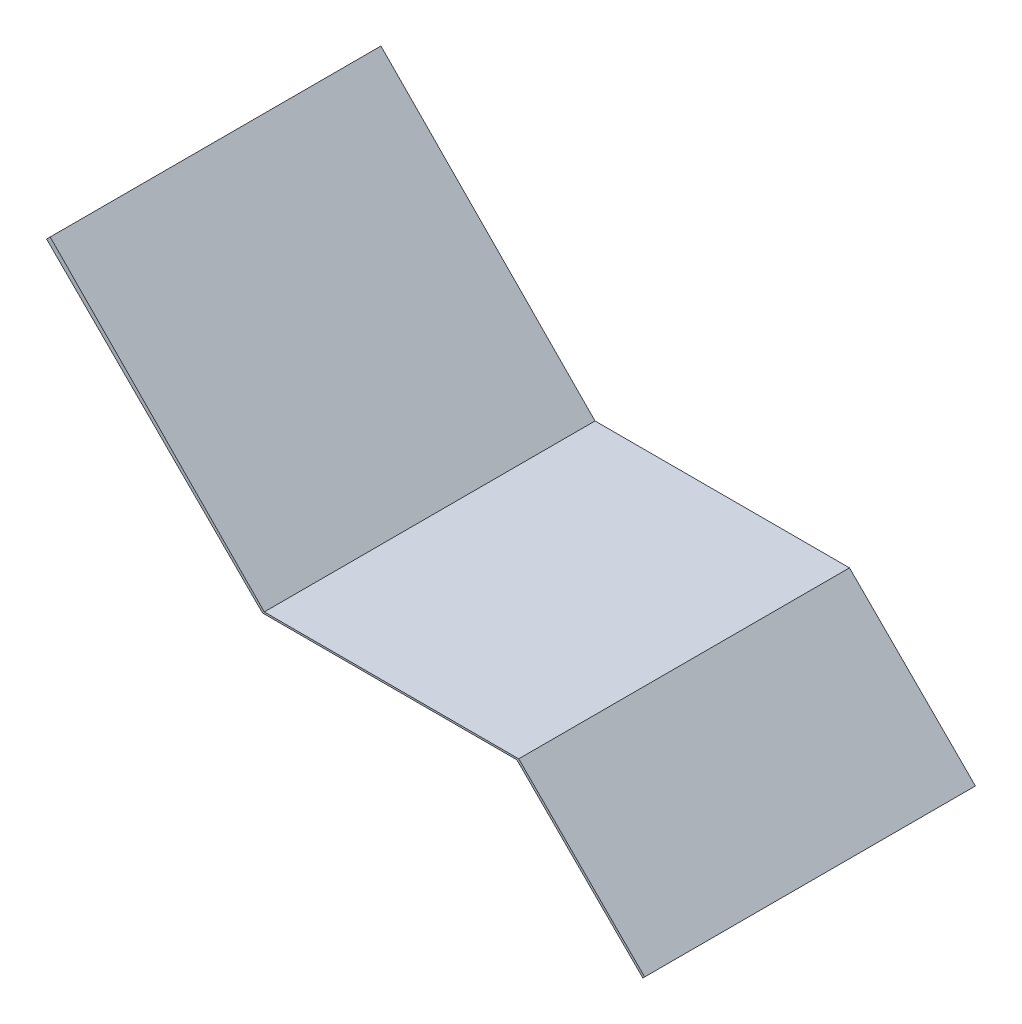
ISO-10303-21;
HEADER;
FILE_DESCRIPTION(('STEP AP214'),'2;1');
FILE_NAME('part.step','',(''),(''),'','','');
FILE_SCHEMA(('AUTOMOTIVE_DESIGN { 1 0 10303 214 1 1 1 1 }'));
ENDSEC;
DATA;
#1=APPLICATION_CONTEXT('core data for automotive mechanical design processes');
#2=APPLICATION_PROTOCOL_DEFINITION('international standard','automotive_design',2000,#1);
#3=PRODUCT_CONTEXT('',#1,'mechanical');
#4=PRODUCT('Part','Part','',(#3));
#5=PRODUCT_RELATED_PRODUCT_CATEGORY('part','',(#4));
#6=PRODUCT_DEFINITION_FORMATION('','',#4);
#7=PRODUCT_DEFINITION_CONTEXT('part definition',#1,'design');
#8=PRODUCT_DEFINITION('design','',#6,#7);
#9=PRODUCT_DEFINITION_SHAPE('','',#8);
#10=(LENGTH_UNIT() NAMED_UNIT(*) SI_UNIT(.MILLI.,.METRE.));
#11=(NAMED_UNIT(*) PLANE_ANGLE_UNIT() SI_UNIT($,.RADIAN.));
#12=(NAMED_UNIT(*) SI_UNIT($,.STERADIAN.) SOLID_ANGLE_UNIT());
#13=UNCERTAINTY_MEASURE_WITH_UNIT(LENGTH_MEASURE(1.E-05),#10,'distance_accuracy_value','');
#14=(GEOMETRIC_REPRESENTATION_CONTEXT(3) GLOBAL_UNCERTAINTY_ASSIGNED_CONTEXT((#13)) GLOBAL_UNIT_ASSIGNED_CONTEXT((#10,
#11,#12)) REPRESENTATION_CONTEXT('',''));
#15=CARTESIAN_POINT('',(0.,0.,0.));
#16=DIRECTION('',(0.,0.,1.));
#17=DIRECTION('',(1.,0.,0.));
#18=AXIS2_PLACEMENT_3D('',#15,#16,#17);
#19=CARTESIAN_POINT('',(-59.4653823744208,52.7228393345862,650.));
#20=DIRECTION('',(0.707106781186547,-0.707106781186547,0.));
#21=DIRECTION('',(0.707106781186548,0.707106781186548,0.));
#22=AXIS2_PLACEMENT_3D('',#19,#20,#21);
#23=PLANE('',#22);
#24=DIRECTION('',(-0.707106781186547,-0.707106781186547,0.));
#25=VECTOR('',#24,1.);
#26=CARTESIAN_POINT('',(-59.4653823744208,52.7228393345862,0.));
#27=LINE('',#26,#25);
#28=CARTESIAN_POINT('',(-59.4653823744208,52.7228393345862,0.));
#29=VERTEX_POINT('',#28);
#30=CARTESIAN_POINT('',(-66.5115885846255,45.6766331243814,0.));
#31=VERTEX_POINT('',#30);
#32=EDGE_CURVE('E131',#29,#31,#27,.T.);
#33=ORIENTED_EDGE('',*,*,#32,.T.);
#34=DIRECTION('',(0.,0.,-1.));
#35=VECTOR('',#34,1.);
#36=CARTESIAN_POINT('',(-66.5115885846255,45.6766331243814,650.));
#37=LINE('',#36,#35);
#38=CARTESIAN_POINT('',(-66.5115885846255,45.6766331243814,650.));
#39=VERTEX_POINT('',#38);
#40=EDGE_CURVE('E11',#39,#31,#37,.T.);
#41=ORIENTED_EDGE('',*,*,#40,.F.);
#42=DIRECTION('',(-0.707106781186547,-0.707106781186547,0.));
#43=VECTOR('',#42,1.);
#44=CARTESIAN_POINT('',(-59.4653823744208,52.7228393345862,650.));
#45=LINE('',#44,#43);
#46=CARTESIAN_POINT('',(-59.4653823744208,52.7228393345862,650.));
#47=VERTEX_POINT('',#46);
#48=EDGE_CURVE('E145',#47,#39,#45,.T.);
#49=ORIENTED_EDGE('',*,*,#48,.F.);
#50=DIRECTION('',(0.,0.,-1.));
#51=VECTOR('',#50,1.);
#52=CARTESIAN_POINT('',(-59.4653823744208,52.7228393345862,650.));
#53=LINE('',#52,#51);
#54=EDGE_CURVE('E127',#47,#29,#53,.T.);
#55=ORIENTED_EDGE('',*,*,#54,.T.);
#56=EDGE_LOOP('',(#33,#41,#49,#55));
#57=FACE_BOUND('',#56,.T.);
#58=ADVANCED_FACE('F35',(#57),#23,.F.);
#59=CARTESIAN_POINT('',(-66.5115885846255,45.6766331243814,650.));
#60=DIRECTION('',(0.707106781186548,0.707106781186548,0.));
#61=DIRECTION('',(-0.707106781186548,0.707106781186548,0.));
#62=AXIS2_PLACEMENT_3D('',#59,#60,#61);
#63=PLANE('',#62);
#64=DIRECTION('',(0.707106781186548,-0.707106781186548,0.));
#65=VECTOR('',#64,1.);
#66=CARTESIAN_POINT('',(-66.5115885846255,45.6766331243814,0.));
#67=LINE('',#66,#65);
#68=CARTESIAN_POINT('',(357.752480127303,-378.587435587547,0.));
#69=VERTEX_POINT('',#68);
#70=EDGE_CURVE('E134',#31,#69,#67,.T.);
#71=ORIENTED_EDGE('',*,*,#70,.T.);
#72=DIRECTION('',(0.,0.,-1.));
#73=VECTOR('',#72,1.);
#74=CARTESIAN_POINT('',(357.752480127303,-378.587435587547,650.));
#75=LINE('',#74,#73);
#76=CARTESIAN_POINT('',(357.752480127303,-378.587435587547,650.));
#77=VERTEX_POINT('',#76);
#78=EDGE_CURVE('E43',#77,#69,#75,.T.);
#79=ORIENTED_EDGE('',*,*,#78,.F.);
#80=DIRECTION('',(0.707106781186548,-0.707106781186548,0.));
#81=VECTOR('',#80,1.);
#82=CARTESIAN_POINT('',(-66.5115885846255,45.6766331243814,650.));
#83=LINE('',#82,#81);
#84=EDGE_CURVE('E94',#39,#77,#83,.T.);
#85=ORIENTED_EDGE('',*,*,#84,.F.);
#86=ORIENTED_EDGE('',*,*,#40,.T.);
#87=EDGE_LOOP('',(#71,#79,#85,#86));
#88=FACE_BOUND('',#87,.T.);
#89=ADVANCED_FACE('F180',(#88),#63,.F.);
#90=CARTESIAN_POINT('',(357.752480127303,-378.587435587547,650.));
#91=DIRECTION('',(0.,1.,0.));
#92=DIRECTION('',(0.,0.,1.));
#93=AXIS2_PLACEMENT_3D('',#90,#91,#92);
#94=PLANE('',#93);
#95=DIRECTION('',(1.,0.,0.));
#96=VECTOR('',#95,1.);
#97=CARTESIAN_POINT('',(357.752480127303,-378.587435587547,0.));
#98=LINE('',#97,#96);
#99=CARTESIAN_POINT('',(857.752480127303,-378.587435587547,0.));
#100=VERTEX_POINT('',#99);
#101=EDGE_CURVE('E136',#69,#100,#98,.T.);
#102=ORIENTED_EDGE('',*,*,#101,.T.);
#103=DIRECTION('',(0.,0.,-1.));
#104=VECTOR('',#103,1.);
#105=CARTESIAN_POINT('',(857.752480127303,-378.587435587547,650.));
#106=LINE('',#105,#104);
#107=CARTESIAN_POINT('',(857.752480127303,-378.587435587547,650.));
#108=VERTEX_POINT('',#107);
#109=EDGE_CURVE('E152',#108,#100,#106,.T.);
#110=ORIENTED_EDGE('',*,*,#109,.F.);
#111=DIRECTION('',(1.,0.,0.));
#112=VECTOR('',#111,1.);
#113=CARTESIAN_POINT('',(357.752480127303,-378.587435587547,650.));
#114=LINE('',#113,#112);
#115=EDGE_CURVE('E160',#77,#108,#114,.T.);
#116=ORIENTED_EDGE('',*,*,#115,.F.);
#117=ORIENTED_EDGE('',*,*,#78,.T.);
#118=EDGE_LOOP('',(#102,#110,#116,#117));
#119=FACE_BOUND('',#118,.T.);
#120=ADVANCED_FACE('F158',(#119),#94,.F.);
#121=CARTESIAN_POINT('',(857.752480127303,-378.587435587547,650.));
#122=DIRECTION('',(0.707106781186548,0.707106781186547,0.));
#123=DIRECTION('',(-0.707106781186547,0.707106781186548,0.));
#124=AXIS2_PLACEMENT_3D('',#121,#122,#123);
#125=PLANE('',#124);
#126=DIRECTION('',(0.707106781186547,-0.707106781186548,0.));
#127=VECTOR('',#126,1.);
#128=CARTESIAN_POINT('',(857.752480127303,-378.587435587547,0.));
#129=LINE('',#128,#127);
#130=CARTESIAN_POINT('',(1105.23985354259,-626.074809002839,0.));
#131=VERTEX_POINT('',#130);
#132=EDGE_CURVE('E138',#100,#131,#129,.T.);
#133=ORIENTED_EDGE('',*,*,#132,.T.);
#134=DIRECTION('',(0.,0.,-1.));
#135=VECTOR('',#134,1.);
#136=CARTESIAN_POINT('',(1105.23985354259,-626.074809002839,650.));
#137=LINE('',#136,#135);
#138=CARTESIAN_POINT('',(1105.23985354259,-626.074809002839,650.));
#139=VERTEX_POINT('',#138);
#140=EDGE_CURVE('E149',#139,#131,#137,.T.);
#141=ORIENTED_EDGE('',*,*,#140,.F.);
#142=DIRECTION('',(0.707106781186547,-0.707106781186548,0.));
#143=VECTOR('',#142,1.);
#144=CARTESIAN_POINT('',(857.752480127303,-378.587435587547,650.));
#145=LINE('',#144,#143);
#146=EDGE_CURVE('E172',#108,#139,#145,.T.);
#147=ORIENTED_EDGE('',*,*,#146,.F.);
#148=ORIENTED_EDGE('',*,*,#109,.T.);
#149=EDGE_LOOP('',(#133,#141,#147,#148));
#150=FACE_BOUND('',#149,.T.);
#151=ADVANCED_FACE('F168',(#150),#125,.F.);
#152=CARTESIAN_POINT('',(1105.23985354259,-626.074809002839,650.));
#153=DIRECTION('',(-0.707106781186559,0.707106781186536,0.));
#154=DIRECTION('',(-0.707106781186536,-0.707106781186559,0.));
#155=AXIS2_PLACEMENT_3D('',#152,#153,#154);
#156=PLANE('',#155);
#157=DIRECTION('',(0.707106781186536,0.707106781186559,0.));
#158=VECTOR('',#157,1.);
#159=CARTESIAN_POINT('',(1105.23985354259,-626.074809002839,0.));
#160=LINE('',#159,#158);
#161=CARTESIAN_POINT('',(1108.77538744853,-622.539275096906,0.));
#162=VERTEX_POINT('',#161);
#163=EDGE_CURVE('E140',#131,#162,#160,.T.);
#164=ORIENTED_EDGE('',*,*,#163,.T.);
#165=DIRECTION('',(0.,0.,-1.));
#166=VECTOR('',#165,1.);
#167=CARTESIAN_POINT('',(1108.77538744853,-622.539275096906,650.));
#168=LINE('',#167,#166);
#169=CARTESIAN_POINT('',(1108.77538744853,-622.539275096906,650.));
#170=VERTEX_POINT('',#169);
#171=EDGE_CURVE('E122',#170,#162,#168,.T.);
#172=ORIENTED_EDGE('',*,*,#171,.F.);
#173=DIRECTION('',(0.707106781186536,0.707106781186559,0.));
#174=VECTOR('',#173,1.);
#175=CARTESIAN_POINT('',(1105.23985354259,-626.074809002839,650.));
#176=LINE('',#175,#174);
#177=EDGE_CURVE('E113',#139,#170,#176,.T.);
#178=ORIENTED_EDGE('',*,*,#177,.F.);
#179=ORIENTED_EDGE('',*,*,#140,.T.);
#180=EDGE_LOOP('',(#164,#172,#178,#179));
#181=FACE_BOUND('',#180,.T.);
#182=ADVANCED_FACE('F171',(#181),#156,.F.);
#183=CARTESIAN_POINT('',(1108.77538744853,-622.539275096906,650.));
#184=DIRECTION('',(-0.707106781186536,-0.707106781186559,0.));
#185=DIRECTION('',(0.707106781186559,-0.707106781186536,0.));
#186=AXIS2_PLACEMENT_3D('',#183,#184,#185);
#187=PLANE('',#186);
#188=DIRECTION('',(-0.707106781186559,0.707106781186536,0.));
#189=VECTOR('',#188,1.);
#190=CARTESIAN_POINT('',(1108.77538744853,-622.539275096906,0.));
#191=LINE('',#190,#189);
#192=CARTESIAN_POINT('',(861.288014033232,-375.051901681618,0.));
#193=VERTEX_POINT('',#192);
#194=EDGE_CURVE('E121',#162,#193,#191,.T.);
#195=ORIENTED_EDGE('',*,*,#194,.T.);
#196=DIRECTION('',(0.,0.,-1.));
#197=VECTOR('',#196,1.);
#198=CARTESIAN_POINT('',(861.288014033232,-375.051901681618,650.));
#199=LINE('',#198,#197);
#200=CARTESIAN_POINT('',(861.288014033232,-375.051901681618,650.));
#201=VERTEX_POINT('',#200);
#202=EDGE_CURVE('E118',#201,#193,#199,.T.);
#203=ORIENTED_EDGE('',*,*,#202,.F.);
#204=DIRECTION('',(-0.707106781186559,0.707106781186536,0.));
#205=VECTOR('',#204,1.);
#206=CARTESIAN_POINT('',(1108.77538744853,-622.539275096906,650.));
#207=LINE('',#206,#205);
#208=EDGE_CURVE('E107',#170,#201,#207,.T.);
#209=ORIENTED_EDGE('',*,*,#208,.F.);
#210=ORIENTED_EDGE('',*,*,#171,.T.);
#211=EDGE_LOOP('',(#195,#203,#209,#210));
#212=FACE_BOUND('',#211,.T.);
#213=ADVANCED_FACE('F119',(#212),#187,.F.);
#214=CARTESIAN_POINT('',(861.288014033232,-375.051901681618,650.));
#215=DIRECTION('',(0.,-1.,0.));
#216=DIRECTION('',(0.,0.,-1.));
#217=AXIS2_PLACEMENT_3D('',#214,#215,#216);
#218=PLANE('',#217);
#219=DIRECTION('',(-1.,0.,0.));
#220=VECTOR('',#219,1.);
#221=CARTESIAN_POINT('',(861.288014033232,-375.051901681618,0.));
#222=LINE('',#221,#220);
#223=CARTESIAN_POINT('',(361.288014033232,-375.051901681618,0.));
#224=VERTEX_POINT('',#223);
#225=EDGE_CURVE('E80',#193,#224,#222,.T.);
#226=ORIENTED_EDGE('',*,*,#225,.T.);
#227=DIRECTION('',(0.,0.,-1.));
#228=VECTOR('',#227,1.);
#229=CARTESIAN_POINT('',(361.288014033232,-375.051901681618,650.));
#230=LINE('',#229,#228);
#231=CARTESIAN_POINT('',(361.288014033232,-375.051901681618,650.));
#232=VERTEX_POINT('',#231);
#233=EDGE_CURVE('E123',#232,#224,#230,.T.);
#234=ORIENTED_EDGE('',*,*,#233,.F.);
#235=DIRECTION('',(-1.,0.,0.));
#236=VECTOR('',#235,1.);
#237=CARTESIAN_POINT('',(861.288014033232,-375.051901681618,650.));
#238=LINE('',#237,#236);
#239=EDGE_CURVE('E111',#201,#232,#238,.T.);
#240=ORIENTED_EDGE('',*,*,#239,.F.);
#241=ORIENTED_EDGE('',*,*,#202,.T.);
#242=EDGE_LOOP('',(#226,#234,#240,#241));
#243=FACE_BOUND('',#242,.T.);
#244=ADVANCED_FACE('F125',(#243),#218,.F.);
#245=CARTESIAN_POINT('',(361.288014033232,-375.051901681618,650.));
#246=DIRECTION('',(-0.712933494397549,-0.701231653996096,0.));
#247=DIRECTION('',(0.701231653996096,-0.712933494397549,0.));
#248=AXIS2_PLACEMENT_3D('',#245,#246,#247);
#249=PLANE('',#248);
#250=DIRECTION('',(-0.701231653996096,0.712933494397549,0.));
#251=VECTOR('',#250,1.);
#252=CARTESIAN_POINT('',(361.288014033232,-375.051901681618,0.));
#253=LINE('',#252,#251);
#254=EDGE_CURVE('E86',#224,#29,#253,.T.);
#255=ORIENTED_EDGE('',*,*,#254,.T.);
#256=ORIENTED_EDGE('',*,*,#54,.F.);
#257=DIRECTION('',(-0.701231653996096,0.712933494397549,0.));
#258=VECTOR('',#257,1.);
#259=CARTESIAN_POINT('',(361.288014033232,-375.051901681618,650.));
#260=LINE('',#259,#258);
#261=EDGE_CURVE('E51',#232,#47,#260,.T.);
#262=ORIENTED_EDGE('',*,*,#261,.F.);
#263=ORIENTED_EDGE('',*,*,#233,.T.);
#264=EDGE_LOOP('',(#255,#256,#262,#263));
#265=FACE_BOUND('',#264,.T.);
#266=ADVANCED_FACE('F196',(#265),#249,.F.);
#267=CARTESIAN_POINT('',(0.,0.,650.));
#268=DIRECTION('',(0.,0.,1.));
#269=DIRECTION('',(1.,0.,0.));
#270=AXIS2_PLACEMENT_3D('',#267,#268,#269);
#271=PLANE('',#270);
#272=ORIENTED_EDGE('',*,*,#48,.T.);
#273=ORIENTED_EDGE('',*,*,#84,.T.);
#274=ORIENTED_EDGE('',*,*,#115,.T.);
#275=ORIENTED_EDGE('',*,*,#146,.T.);
#276=ORIENTED_EDGE('',*,*,#177,.T.);
#277=ORIENTED_EDGE('',*,*,#208,.T.);
#278=ORIENTED_EDGE('',*,*,#239,.T.);
#279=ORIENTED_EDGE('',*,*,#261,.T.);
#280=EDGE_LOOP('',(#272,#273,#274,#275,#276,#277,#278,#279));
#281=FACE_BOUND('',#280,.T.);
#282=ADVANCED_FACE('F109',(#281),#271,.T.);
#283=CARTESIAN_POINT('',(0.,0.,0.));
#284=DIRECTION('',(0.,0.,1.));
#285=DIRECTION('',(1.,0.,0.));
#286=AXIS2_PLACEMENT_3D('',#283,#284,#285);
#287=PLANE('',#286);
#288=ORIENTED_EDGE('',*,*,#32,.F.);
#289=ORIENTED_EDGE('',*,*,#254,.F.);
#290=ORIENTED_EDGE('',*,*,#225,.F.);
#291=ORIENTED_EDGE('',*,*,#194,.F.);
#292=ORIENTED_EDGE('',*,*,#163,.F.);
#293=ORIENTED_EDGE('',*,*,#132,.F.);
#294=ORIENTED_EDGE('',*,*,#101,.F.);
#295=ORIENTED_EDGE('',*,*,#70,.F.);
#296=EDGE_LOOP('',(#288,#289,#290,#291,#292,#293,#294,#295));
#297=FACE_BOUND('',#296,.T.);
#298=ADVANCED_FACE('F164',(#297),#287,.F.);
#299=CLOSED_SHELL('',(#58,#89,#120,#151,#182,#213,#244,#266,#282,#298));
#300=MANIFOLD_SOLID_BREP('B2',#299);
#301=ADVANCED_BREP_SHAPE_REPRESENTATION('',(#18,#300),#14);
#302=SHAPE_DEFINITION_REPRESENTATION(#9,#301);
ENDSEC;
END-ISO-10303-21;
